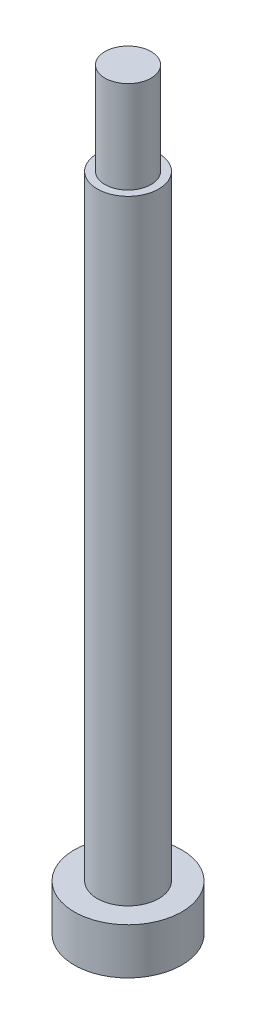
ISO-10303-21;
HEADER;
FILE_DESCRIPTION(('STEP AP214'),'2;1');
FILE_NAME('part.step','',(''),(''),'','','');
FILE_SCHEMA(('AUTOMOTIVE_DESIGN { 1 0 10303 214 1 1 1 1 }'));
ENDSEC;
DATA;
#1=APPLICATION_CONTEXT('core data for automotive mechanical design processes');
#2=APPLICATION_PROTOCOL_DEFINITION('international standard','automotive_design',2000,#1);
#3=PRODUCT_CONTEXT('',#1,'mechanical');
#4=PRODUCT('Part','Part','',(#3));
#5=PRODUCT_RELATED_PRODUCT_CATEGORY('part','',(#4));
#6=PRODUCT_DEFINITION_FORMATION('','',#4);
#7=PRODUCT_DEFINITION_CONTEXT('part definition',#1,'design');
#8=PRODUCT_DEFINITION('design','',#6,#7);
#9=PRODUCT_DEFINITION_SHAPE('','',#8);
#10=(LENGTH_UNIT() NAMED_UNIT(*) SI_UNIT(.MILLI.,.METRE.));
#11=(NAMED_UNIT(*) PLANE_ANGLE_UNIT() SI_UNIT($,.RADIAN.));
#12=(NAMED_UNIT(*) SI_UNIT($,.STERADIAN.) SOLID_ANGLE_UNIT());
#13=UNCERTAINTY_MEASURE_WITH_UNIT(LENGTH_MEASURE(1.E-05),#10,'distance_accuracy_value','');
#14=(GEOMETRIC_REPRESENTATION_CONTEXT(3) GLOBAL_UNCERTAINTY_ASSIGNED_CONTEXT((#13)) GLOBAL_UNIT_ASSIGNED_CONTEXT((#10,
#11,#12)) REPRESENTATION_CONTEXT('',''));
#15=CARTESIAN_POINT('',(0.,0.,0.));
#16=DIRECTION('',(0.,0.,1.));
#17=DIRECTION('',(1.,0.,0.));
#18=AXIS2_PLACEMENT_3D('',#15,#16,#17);
#19=CARTESIAN_POINT('',(0.,40.,0.));
#20=DIRECTION('',(0.,-1.,0.));
#21=DIRECTION('',(0.,0.,-1.));
#22=AXIS2_PLACEMENT_3D('',#19,#20,#21);
#23=CYLINDRICAL_SURFACE('',#22,2.);
#24=CARTESIAN_POINT('',(0.,40.,0.));
#25=DIRECTION('',(0.,1.,0.));
#26=DIRECTION('',(0.,0.,1.));
#27=AXIS2_PLACEMENT_3D('',#24,#25,#26);
#28=CIRCLE('',#27,2.);
#29=CARTESIAN_POINT('',(0.,40.,2.));
#30=VERTEX_POINT('',#29);
#31=EDGE_CURVE('E47',#30,#30,#28,.T.);
#32=ORIENTED_EDGE('',*,*,#31,.F.);
#33=EDGE_LOOP('',(#32));
#34=FACE_BOUND('',#33,.T.);
#35=CARTESIAN_POINT('',(0.,0.,0.));
#36=DIRECTION('',(0.,1.,0.));
#37=DIRECTION('',(0.,0.,1.));
#38=AXIS2_PLACEMENT_3D('',#35,#36,#37);
#39=CIRCLE('',#38,2.);
#40=CARTESIAN_POINT('',(0.,0.,2.));
#41=VERTEX_POINT('',#40);
#42=EDGE_CURVE('E42',#41,#41,#39,.T.);
#43=ORIENTED_EDGE('',*,*,#42,.T.);
#44=EDGE_LOOP('',(#43));
#45=FACE_BOUND('',#44,.T.);
#46=ADVANCED_FACE('F39',(#34,#45),#23,.T.);
#47=CARTESIAN_POINT('',(0.,40.,0.));
#48=DIRECTION('',(0.,1.,0.));
#49=DIRECTION('',(0.,0.,1.));
#50=AXIS2_PLACEMENT_3D('',#47,#48,#49);
#51=PLANE('',#50);
#52=CARTESIAN_POINT('',(0.,40.,0.));
#53=DIRECTION('',(0.,1.,0.));
#54=DIRECTION('',(0.,0.,1.));
#55=AXIS2_PLACEMENT_3D('',#52,#53,#54);
#56=CIRCLE('',#55,1.5);
#57=CARTESIAN_POINT('',(0.,40.,1.5));
#58=VERTEX_POINT('',#57);
#59=EDGE_CURVE('E10',#58,#58,#56,.T.);
#60=ORIENTED_EDGE('',*,*,#59,.F.);
#61=EDGE_LOOP('',(#60));
#62=FACE_BOUND('',#61,.T.);
#63=ORIENTED_EDGE('',*,*,#31,.T.);
#64=EDGE_LOOP('',(#63));
#65=FACE_BOUND('',#64,.T.);
#66=ADVANCED_FACE('F93',(#62,#65),#51,.T.);
#67=CARTESIAN_POINT('',(0.,46.,0.));
#68=DIRECTION('',(0.,-1.,0.));
#69=DIRECTION('',(0.,0.,-1.));
#70=AXIS2_PLACEMENT_3D('',#67,#68,#69);
#71=CYLINDRICAL_SURFACE('',#70,1.5);
#72=CARTESIAN_POINT('',(0.,46.,0.));
#73=DIRECTION('',(0.,1.,0.));
#74=DIRECTION('',(0.,0.,1.));
#75=AXIS2_PLACEMENT_3D('',#72,#73,#74);
#76=CIRCLE('',#75,1.5);
#77=CARTESIAN_POINT('',(0.,46.,1.5));
#78=VERTEX_POINT('',#77);
#79=EDGE_CURVE('E53',#78,#78,#76,.T.);
#80=ORIENTED_EDGE('',*,*,#79,.F.);
#81=EDGE_LOOP('',(#80));
#82=FACE_BOUND('',#81,.T.);
#83=ORIENTED_EDGE('',*,*,#59,.T.);
#84=EDGE_LOOP('',(#83));
#85=FACE_BOUND('',#84,.T.);
#86=ADVANCED_FACE('F89',(#82,#85),#71,.T.);
#87=CARTESIAN_POINT('',(0.,46.,0.));
#88=DIRECTION('',(0.,1.,0.));
#89=DIRECTION('',(0.,0.,1.));
#90=AXIS2_PLACEMENT_3D('',#87,#88,#89);
#91=PLANE('',#90);
#92=ORIENTED_EDGE('',*,*,#79,.T.);
#93=EDGE_LOOP('',(#92));
#94=FACE_BOUND('',#93,.T.);
#95=ADVANCED_FACE('F81',(#94),#91,.T.);
#96=CARTESIAN_POINT('',(0.,-3.,0.));
#97=DIRECTION('',(0.,1.,0.));
#98=DIRECTION('',(0.,0.,1.));
#99=AXIS2_PLACEMENT_3D('',#96,#97,#98);
#100=CYLINDRICAL_SURFACE('',#99,3.5);
#101=CARTESIAN_POINT('',(0.,-3.,0.));
#102=DIRECTION('',(0.,-1.,0.));
#103=DIRECTION('',(0.,0.,-1.));
#104=AXIS2_PLACEMENT_3D('',#101,#102,#103);
#105=CIRCLE('',#104,3.5);
#106=CARTESIAN_POINT('',(0.,-3.,-3.5));
#107=VERTEX_POINT('',#106);
#108=EDGE_CURVE('E62',#107,#107,#105,.T.);
#109=ORIENTED_EDGE('',*,*,#108,.F.);
#110=EDGE_LOOP('',(#109));
#111=FACE_BOUND('',#110,.T.);
#112=CARTESIAN_POINT('',(0.,0.,0.));
#113=DIRECTION('',(0.,-1.,0.));
#114=DIRECTION('',(0.,0.,-1.));
#115=AXIS2_PLACEMENT_3D('',#112,#113,#114);
#116=CIRCLE('',#115,3.5);
#117=CARTESIAN_POINT('',(0.,0.,-3.5));
#118=VERTEX_POINT('',#117);
#119=EDGE_CURVE('E58',#118,#118,#116,.T.);
#120=ORIENTED_EDGE('',*,*,#119,.T.);
#121=EDGE_LOOP('',(#120));
#122=FACE_BOUND('',#121,.T.);
#123=ADVANCED_FACE('F79',(#111,#122),#100,.T.);
#124=CARTESIAN_POINT('',(0.,-3.,0.));
#125=DIRECTION('',(0.,-1.,0.));
#126=DIRECTION('',(0.,0.,-1.));
#127=AXIS2_PLACEMENT_3D('',#124,#125,#126);
#128=PLANE('',#127);
#129=ORIENTED_EDGE('',*,*,#108,.T.);
#130=EDGE_LOOP('',(#129));
#131=FACE_BOUND('',#130,.T.);
#132=ADVANCED_FACE('F75',(#131),#128,.T.);
#133=CARTESIAN_POINT('',(0.,0.,0.));
#134=DIRECTION('',(0.,-1.,0.));
#135=DIRECTION('',(0.,0.,-1.));
#136=AXIS2_PLACEMENT_3D('',#133,#134,#135);
#137=PLANE('',#136);
#138=ORIENTED_EDGE('',*,*,#42,.F.);
#139=EDGE_LOOP('',(#138));
#140=FACE_BOUND('',#139,.T.);
#141=ORIENTED_EDGE('',*,*,#119,.F.);
#142=EDGE_LOOP('',(#141));
#143=FACE_BOUND('',#142,.T.);
#144=ADVANCED_FACE('F72',(#140,#143),#137,.F.);
#145=CLOSED_SHELL('',(#46,#66,#86,#95,#123,#132,#144));
#146=MANIFOLD_SOLID_BREP('B2',#145);
#147=ADVANCED_BREP_SHAPE_REPRESENTATION('',(#18,#146),#14);
#148=SHAPE_DEFINITION_REPRESENTATION(#9,#147);
ENDSEC;
END-ISO-10303-21;
